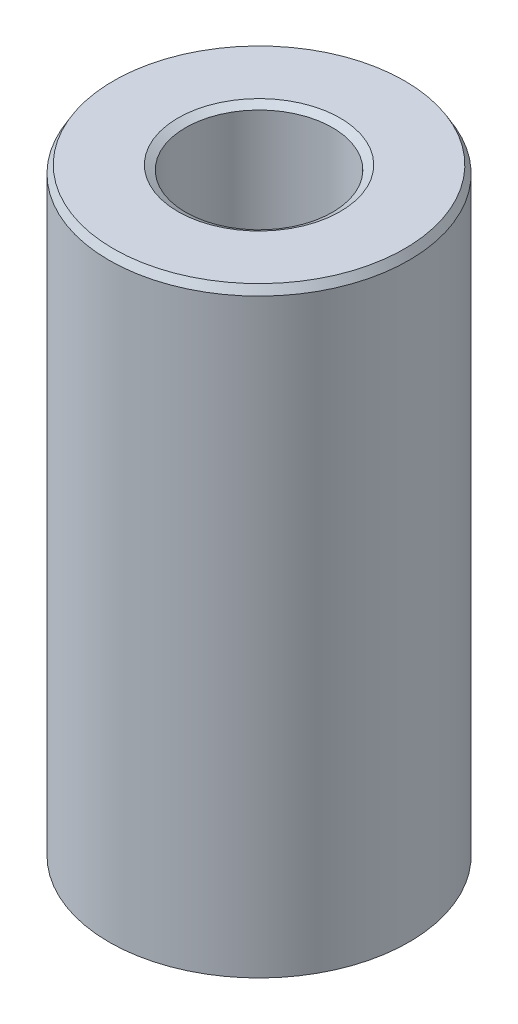
ISO-10303-21;
HEADER;
FILE_DESCRIPTION(('STEP AP214'),'2;1');
FILE_NAME('part.step','',(''),(''),'','','');
FILE_SCHEMA(('AUTOMOTIVE_DESIGN { 1 0 10303 214 1 1 1 1 }'));
ENDSEC;
DATA;
#1=APPLICATION_CONTEXT('core data for automotive mechanical design processes');
#2=APPLICATION_PROTOCOL_DEFINITION('international standard','automotive_design',2000,#1);
#3=PRODUCT_CONTEXT('',#1,'mechanical');
#4=PRODUCT('Part','Part','',(#3));
#5=PRODUCT_RELATED_PRODUCT_CATEGORY('part','',(#4));
#6=PRODUCT_DEFINITION_FORMATION('','',#4);
#7=PRODUCT_DEFINITION_CONTEXT('part definition',#1,'design');
#8=PRODUCT_DEFINITION('design','',#6,#7);
#9=PRODUCT_DEFINITION_SHAPE('','',#8);
#10=(LENGTH_UNIT() NAMED_UNIT(*) SI_UNIT(.MILLI.,.METRE.));
#11=(NAMED_UNIT(*) PLANE_ANGLE_UNIT() SI_UNIT($,.RADIAN.));
#12=(NAMED_UNIT(*) SI_UNIT($,.STERADIAN.) SOLID_ANGLE_UNIT());
#13=UNCERTAINTY_MEASURE_WITH_UNIT(LENGTH_MEASURE(1.E-05),#10,'distance_accuracy_value','');
#14=(GEOMETRIC_REPRESENTATION_CONTEXT(3) GLOBAL_UNCERTAINTY_ASSIGNED_CONTEXT((#13)) GLOBAL_UNIT_ASSIGNED_CONTEXT((#10,
#11,#12)) REPRESENTATION_CONTEXT('',''));
#15=CARTESIAN_POINT('',(0.,0.,0.));
#16=DIRECTION('',(0.,0.,1.));
#17=DIRECTION('',(1.,0.,0.));
#18=AXIS2_PLACEMENT_3D('',#15,#16,#17);
#19=CARTESIAN_POINT('',(0.,180.820248517699,0.));
#20=DIRECTION('',(0.,-1.,0.));
#21=DIRECTION('',(0.,0.,-1.));
#22=AXIS2_PLACEMENT_3D('',#19,#20,#21);
#23=CYLINDRICAL_SURFACE('',#22,45.);
#24=CARTESIAN_POINT('',(0.,1.3342997693557,0.));
#25=DIRECTION('',(0.,1.,0.));
#26=DIRECTION('',(0.,0.,1.));
#27=AXIS2_PLACEMENT_3D('',#24,#25,#26);
#28=CIRCLE('',#27,45.);
#29=CARTESIAN_POINT('',(0.,1.3342997693557,45.));
#30=VERTEX_POINT('',#29);
#31=EDGE_CURVE('E10',#30,#30,#28,.T.);
#32=ORIENTED_EDGE('',*,*,#31,.T.);
#33=EDGE_LOOP('',(#32));
#34=FACE_BOUND('',#33,.T.);
#35=CARTESIAN_POINT('',(0.,178.509173524647,0.));
#36=DIRECTION('',(0.,1.,0.));
#37=DIRECTION('',(0.,0.,1.));
#38=AXIS2_PLACEMENT_3D('',#35,#36,#37);
#39=CIRCLE('',#38,45.);
#40=CARTESIAN_POINT('',(0.,178.509173524647,45.));
#41=VERTEX_POINT('',#40);
#42=EDGE_CURVE('E50',#41,#41,#39,.F.);
#43=ORIENTED_EDGE('',*,*,#42,.T.);
#44=EDGE_LOOP('',(#43));
#45=FACE_BOUND('',#44,.T.);
#46=ADVANCED_FACE('F39',(#34,#45),#23,.T.);
#47=CARTESIAN_POINT('',(0.,180.820248517699,0.));
#48=DIRECTION('',(0.,1.,0.));
#49=DIRECTION('',(0.,0.,1.));
#50=AXIS2_PLACEMENT_3D('',#47,#48,#49);
#51=PLANE('',#50);
#52=CARTESIAN_POINT('',(0.,180.820248517699,0.));
#53=DIRECTION('',(0.,1.,0.));
#54=DIRECTION('',(0.,0.,1.));
#55=AXIS2_PLACEMENT_3D('',#52,#53,#54);
#56=CIRCLE('',#55,24.3378335407773);
#57=CARTESIAN_POINT('',(0.,180.820248517699,24.3378335407773));
#58=VERTEX_POINT('',#57);
#59=EDGE_CURVE('E58',#58,#58,#56,.F.);
#60=ORIENTED_EDGE('',*,*,#59,.T.);
#61=EDGE_LOOP('',(#60));
#62=FACE_BOUND('',#61,.T.);
#63=CARTESIAN_POINT('',(0.,180.820248517699,0.));
#64=DIRECTION('',(0.,1.,0.));
#65=DIRECTION('',(0.,0.,1.));
#66=AXIS2_PLACEMENT_3D('',#63,#64,#65);
#67=CIRCLE('',#66,43.6657002306443);
#68=CARTESIAN_POINT('',(0.,180.820248517699,43.6657002306443));
#69=VERTEX_POINT('',#68);
#70=EDGE_CURVE('E61',#69,#69,#67,.T.);
#71=ORIENTED_EDGE('',*,*,#70,.T.);
#72=EDGE_LOOP('',(#71));
#73=FACE_BOUND('',#72,.T.);
#74=ADVANCED_FACE('F88',(#62,#73),#51,.T.);
#75=CARTESIAN_POINT('',(0.,0.,0.));
#76=DIRECTION('',(0.,1.,0.));
#77=DIRECTION('',(0.,0.,1.));
#78=AXIS2_PLACEMENT_3D('',#75,#76,#77);
#79=PLANE('',#78);
#80=CARTESIAN_POINT('',(0.,0.,0.));
#81=DIRECTION('',(0.,1.,0.));
#82=DIRECTION('',(0.,0.,1.));
#83=AXIS2_PLACEMENT_3D('',#80,#81,#82);
#84=CIRCLE('',#83,23.3610583170815);
#85=CARTESIAN_POINT('',(0.,0.,23.3610583170815));
#86=VERTEX_POINT('',#85);
#87=EDGE_CURVE('E51',#86,#86,#84,.T.);
#88=ORIENTED_EDGE('',*,*,#87,.T.);
#89=EDGE_LOOP('',(#88));
#90=FACE_BOUND('',#89,.T.);
#91=CARTESIAN_POINT('',(0.,0.,0.));
#92=DIRECTION('',(0.,1.,0.));
#93=DIRECTION('',(0.,0.,1.));
#94=AXIS2_PLACEMENT_3D('',#91,#92,#93);
#95=CIRCLE('',#94,42.6889250069485);
#96=CARTESIAN_POINT('',(0.,0.,42.6889250069485));
#97=VERTEX_POINT('',#96);
#98=EDGE_CURVE('E54',#97,#97,#95,.F.);
#99=ORIENTED_EDGE('',*,*,#98,.T.);
#100=EDGE_LOOP('',(#99));
#101=FACE_BOUND('',#100,.T.);
#102=ADVANCED_FACE('F83',(#90,#101),#79,.F.);
#103=CARTESIAN_POINT('',(0.,180.820248517699,0.));
#104=DIRECTION('',(0.,-1.,0.));
#105=DIRECTION('',(0.,0.,-1.));
#106=AXIS2_PLACEMENT_3D('',#103,#104,#105);
#107=CYLINDRICAL_SURFACE('',#106,22.0267585477258);
#108=CARTESIAN_POINT('',(0.,179.485948748343,0.));
#109=DIRECTION('',(0.,1.,0.));
#110=DIRECTION('',(0.,0.,1.));
#111=AXIS2_PLACEMENT_3D('',#108,#109,#110);
#112=CIRCLE('',#111,22.0267585477258);
#113=CARTESIAN_POINT('',(0.,179.485948748343,22.0267585477258));
#114=VERTEX_POINT('',#113);
#115=EDGE_CURVE('E67',#114,#114,#112,.T.);
#116=ORIENTED_EDGE('',*,*,#115,.T.);
#117=EDGE_LOOP('',(#116));
#118=FACE_BOUND('',#117,.T.);
#119=CARTESIAN_POINT('',(0.,2.3110749930515,0.));
#120=DIRECTION('',(0.,1.,0.));
#121=DIRECTION('',(0.,0.,1.));
#122=AXIS2_PLACEMENT_3D('',#119,#120,#121);
#123=CIRCLE('',#122,22.0267585477258);
#124=CARTESIAN_POINT('',(0.,2.3110749930515,22.0267585477258));
#125=VERTEX_POINT('',#124);
#126=EDGE_CURVE('E69',#125,#125,#123,.F.);
#127=ORIENTED_EDGE('',*,*,#126,.T.);
#128=EDGE_LOOP('',(#127));
#129=FACE_BOUND('',#128,.T.);
#130=ADVANCED_FACE('F71',(#118,#129),#107,.F.);
#131=CARTESIAN_POINT('',(0.,179.485948748343,0.));
#132=DIRECTION('',(0.,1.,0.));
#133=DIRECTION('',(0.,0.,1.));
#134=AXIS2_PLACEMENT_3D('',#131,#132,#133);
#135=CONICAL_SURFACE('',#134,22.0267585477258,1.04719755119661);
#136=ORIENTED_EDGE('',*,*,#59,.F.);
#137=EDGE_LOOP('',(#136));
#138=FACE_BOUND('',#137,.T.);
#139=ORIENTED_EDGE('',*,*,#115,.F.);
#140=EDGE_LOOP('',(#139));
#141=FACE_BOUND('',#140,.T.);
#142=ADVANCED_FACE('F77',(#138,#141),#135,.F.);
#143=CARTESIAN_POINT('',(0.,0.,0.));
#144=DIRECTION('',(0.,-1.,0.));
#145=DIRECTION('',(0.,0.,-1.));
#146=AXIS2_PLACEMENT_3D('',#143,#144,#145);
#147=CONICAL_SURFACE('',#146,23.3610583170815,0.523598775598299);
#148=ORIENTED_EDGE('',*,*,#126,.F.);
#149=EDGE_LOOP('',(#148));
#150=FACE_BOUND('',#149,.T.);
#151=ORIENTED_EDGE('',*,*,#87,.F.);
#152=EDGE_LOOP('',(#151));
#153=FACE_BOUND('',#152,.T.);
#154=ADVANCED_FACE('F73',(#150,#153),#147,.F.);
#155=CARTESIAN_POINT('',(0.,1.3342997693557,0.));
#156=DIRECTION('',(0.,1.,0.));
#157=DIRECTION('',(0.,0.,1.));
#158=AXIS2_PLACEMENT_3D('',#155,#156,#157);
#159=CONICAL_SURFACE('',#158,45.,1.0471975511966);
#160=ORIENTED_EDGE('',*,*,#98,.F.);
#161=EDGE_LOOP('',(#160));
#162=FACE_BOUND('',#161,.T.);
#163=ORIENTED_EDGE('',*,*,#31,.F.);
#164=EDGE_LOOP('',(#163));
#165=FACE_BOUND('',#164,.T.);
#166=ADVANCED_FACE('F76',(#162,#165),#159,.T.);
#167=CARTESIAN_POINT('',(0.,180.820248517699,0.));
#168=DIRECTION('',(0.,-1.,0.));
#169=DIRECTION('',(0.,0.,-1.));
#170=AXIS2_PLACEMENT_3D('',#167,#168,#169);
#171=CONICAL_SURFACE('',#170,43.6657002306443,0.523598775598294);
#172=ORIENTED_EDGE('',*,*,#42,.F.);
#173=EDGE_LOOP('',(#172));
#174=FACE_BOUND('',#173,.T.);
#175=ORIENTED_EDGE('',*,*,#70,.F.);
#176=EDGE_LOOP('',(#175));
#177=FACE_BOUND('',#176,.T.);
#178=ADVANCED_FACE('F45',(#174,#177),#171,.T.);
#179=CLOSED_SHELL('',(#46,#74,#102,#130,#142,#154,#166,#178));
#180=MANIFOLD_SOLID_BREP('B2',#179);
#181=ADVANCED_BREP_SHAPE_REPRESENTATION('',(#18,#180),#14);
#182=SHAPE_DEFINITION_REPRESENTATION(#9,#181);
ENDSEC;
END-ISO-10303-21;
